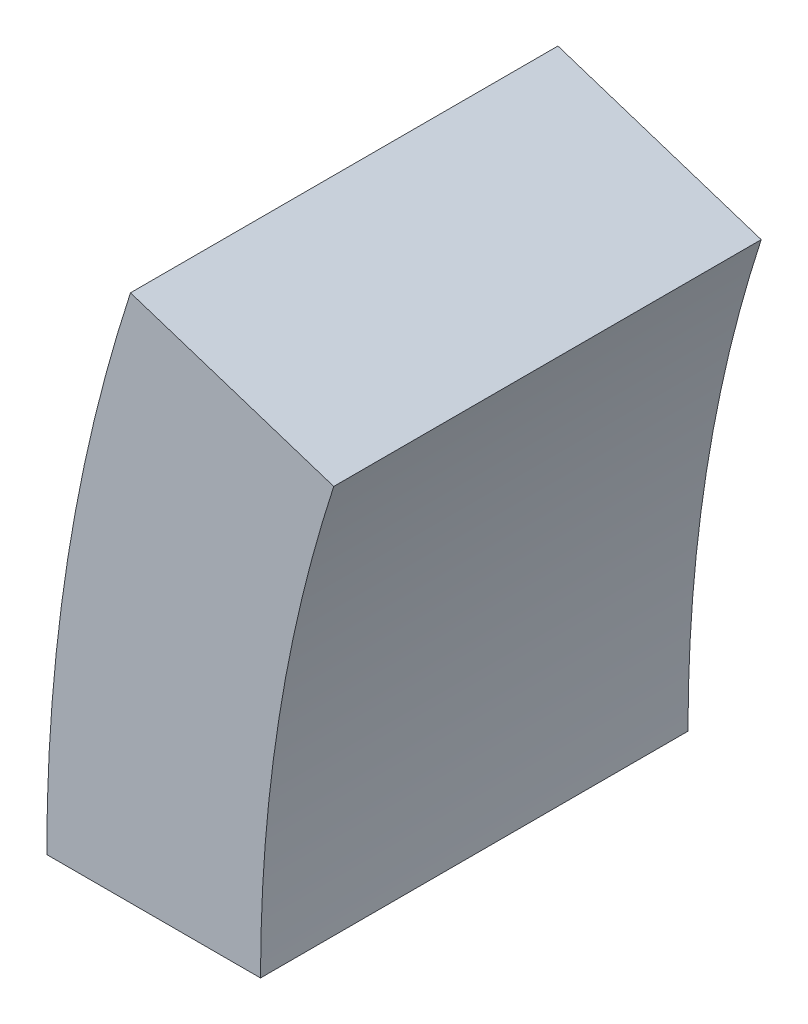
ISO-10303-21;
HEADER;
FILE_DESCRIPTION(('STEP AP214'),'2;1');
FILE_NAME('part.step','',(''),(''),'','','');
FILE_SCHEMA(('AUTOMOTIVE_DESIGN { 1 0 10303 214 1 1 1 1 }'));
ENDSEC;
DATA;
#1=APPLICATION_CONTEXT('core data for automotive mechanical design processes');
#2=APPLICATION_PROTOCOL_DEFINITION('international standard','automotive_design',2000,#1);
#3=PRODUCT_CONTEXT('',#1,'mechanical');
#4=PRODUCT('Part','Part','',(#3));
#5=PRODUCT_RELATED_PRODUCT_CATEGORY('part','',(#4));
#6=PRODUCT_DEFINITION_FORMATION('','',#4);
#7=PRODUCT_DEFINITION_CONTEXT('part definition',#1,'design');
#8=PRODUCT_DEFINITION('design','',#6,#7);
#9=PRODUCT_DEFINITION_SHAPE('','',#8);
#10=(LENGTH_UNIT() NAMED_UNIT(*) SI_UNIT(.MILLI.,.METRE.));
#11=(NAMED_UNIT(*) PLANE_ANGLE_UNIT() SI_UNIT($,.RADIAN.));
#12=(NAMED_UNIT(*) SI_UNIT($,.STERADIAN.) SOLID_ANGLE_UNIT());
#13=UNCERTAINTY_MEASURE_WITH_UNIT(LENGTH_MEASURE(1.E-05),#10,'distance_accuracy_value','');
#14=(GEOMETRIC_REPRESENTATION_CONTEXT(3) GLOBAL_UNCERTAINTY_ASSIGNED_CONTEXT((#13)) GLOBAL_UNIT_ASSIGNED_CONTEXT((#10,
#11,#12)) REPRESENTATION_CONTEXT('',''));
#15=CARTESIAN_POINT('',(0.,0.,0.));
#16=DIRECTION('',(0.,0.,1.));
#17=DIRECTION('',(1.,0.,0.));
#18=AXIS2_PLACEMENT_3D('',#15,#16,#17);
#19=CARTESIAN_POINT('',(692.484918906787,2131.24943466149,624.));
#20=DIRECTION('',(-0.309016994374956,-0.951056516295151,0.));
#21=DIRECTION('',(0.951056516295151,-0.309016994374956,0.));
#22=AXIS2_PLACEMENT_3D('',#19,#20,#21);
#23=PLANE('',#22);
#24=DIRECTION('',(-0.951056516295151,0.309016994374956,0.));
#25=VECTOR('',#24,1.);
#26=CARTESIAN_POINT('',(692.484918906787,2131.24943466149,0.));
#27=LINE('',#26,#25);
#28=CARTESIAN_POINT('',(-10189.1074315886,5666.89311571489,0.));
#29=VERTEX_POINT('',#28);
#30=CARTESIAN_POINT('',(-10485.8370646727,5763.30641795987,0.));
#31=VERTEX_POINT('',#30);
#32=EDGE_CURVE('E100',#29,#31,#27,.T.);
#33=ORIENTED_EDGE('',*,*,#32,.T.);
#34=DIRECTION('',(0.,0.,-1.));
#35=VECTOR('',#34,1.);
#36=CARTESIAN_POINT('',(-10485.8370646727,5763.30641795987,624.));
#37=LINE('',#36,#35);
#38=CARTESIAN_POINT('',(-10485.8370646727,5763.30641795987,624.));
#39=VERTEX_POINT('',#38);
#40=EDGE_CURVE('E11',#39,#31,#37,.T.);
#41=ORIENTED_EDGE('',*,*,#40,.F.);
#42=DIRECTION('',(-0.951056516295151,0.309016994374956,0.));
#43=VECTOR('',#42,1.);
#44=CARTESIAN_POINT('',(692.484918906787,2131.24943466149,624.));
#45=LINE('',#44,#43);
#46=CARTESIAN_POINT('',(-10189.1074315886,5666.89311571489,624.));
#47=VERTEX_POINT('',#46);
#48=EDGE_CURVE('E86',#47,#39,#45,.T.);
#49=ORIENTED_EDGE('',*,*,#48,.F.);
#50=DIRECTION('',(0.,0.,-1.));
#51=VECTOR('',#50,1.);
#52=CARTESIAN_POINT('',(-10189.1074315886,5666.89311571489,624.));
#53=LINE('',#52,#51);
#54=EDGE_CURVE('E53',#47,#29,#53,.T.);
#55=ORIENTED_EDGE('',*,*,#54,.T.);
#56=EDGE_LOOP('',(#33,#41,#49,#55));
#57=FACE_BOUND('',#56,.T.);
#58=ADVANCED_FACE('F37',(#57),#23,.F.);
#59=CARTESIAN_POINT('',(-8112.,4992.,624.));
#60=DIRECTION('',(0.,0.,-1.));
#61=DIRECTION('',(-1.,0.,0.));
#62=AXIS2_PLACEMENT_3D('',#59,#60,#61);
#63=CYLINDRICAL_SURFACE('',#62,2496.);
#64=CARTESIAN_POINT('',(-8112.,4992.,0.));
#65=DIRECTION('',(0.,0.,1.));
#66=DIRECTION('',(1.,0.,0.));
#67=AXIS2_PLACEMENT_3D('',#64,#65,#66);
#68=CIRCLE('',#67,2496.);
#69=CARTESIAN_POINT('',(-10608.,4992.,0.));
#70=VERTEX_POINT('',#69);
#71=EDGE_CURVE('E91',#31,#70,#68,.T.);
#72=ORIENTED_EDGE('',*,*,#71,.T.);
#73=DIRECTION('',(0.,0.,-1.));
#74=VECTOR('',#73,1.);
#75=CARTESIAN_POINT('',(-10608.,4992.,624.));
#76=LINE('',#75,#74);
#77=CARTESIAN_POINT('',(-10608.,4992.,624.));
#78=VERTEX_POINT('',#77);
#79=EDGE_CURVE('E45',#78,#70,#76,.T.);
#80=ORIENTED_EDGE('',*,*,#79,.F.);
#81=CARTESIAN_POINT('',(-8112.,4992.,624.));
#82=DIRECTION('',(0.,0.,1.));
#83=DIRECTION('',(1.,0.,0.));
#84=AXIS2_PLACEMENT_3D('',#81,#82,#83);
#85=CIRCLE('',#84,2496.);
#86=EDGE_CURVE('E78',#39,#78,#85,.T.);
#87=ORIENTED_EDGE('',*,*,#86,.F.);
#88=ORIENTED_EDGE('',*,*,#40,.T.);
#89=EDGE_LOOP('',(#72,#80,#87,#88));
#90=FACE_BOUND('',#89,.T.);
#91=ADVANCED_FACE('F90',(#90),#63,.T.);
#92=CARTESIAN_POINT('',(9.23705556488126E-12,4991.99999999998,624.));
#93=DIRECTION('',(0.,-1.,0.));
#94=DIRECTION('',(1.,0.,0.));
#95=AXIS2_PLACEMENT_3D('',#92,#93,#94);
#96=PLANE('',#95);
#97=DIRECTION('',(-1.,0.,0.));
#98=VECTOR('',#97,1.);
#99=CARTESIAN_POINT('',(9.23705556488126E-12,4991.99999999998,0.));
#100=LINE('',#99,#98);
#101=CARTESIAN_POINT('',(-10296.,4992.,0.));
#102=VERTEX_POINT('',#101);
#103=EDGE_CURVE('E103',#102,#70,#100,.T.);
#104=ORIENTED_EDGE('',*,*,#103,.F.);
#105=DIRECTION('',(0.,0.,-1.));
#106=VECTOR('',#105,1.);
#107=CARTESIAN_POINT('',(-10296.,4992.,624.));
#108=LINE('',#107,#106);
#109=CARTESIAN_POINT('',(-10296.,4992.,624.));
#110=VERTEX_POINT('',#109);
#111=EDGE_CURVE('E67',#110,#102,#108,.T.);
#112=ORIENTED_EDGE('',*,*,#111,.F.);
#113=DIRECTION('',(-1.,0.,0.));
#114=VECTOR('',#113,1.);
#115=CARTESIAN_POINT('',(9.23705556488126E-12,4991.99999999998,624.));
#116=LINE('',#115,#114);
#117=EDGE_CURVE('E85',#110,#78,#116,.T.);
#118=ORIENTED_EDGE('',*,*,#117,.T.);
#119=ORIENTED_EDGE('',*,*,#79,.T.);
#120=EDGE_LOOP('',(#104,#112,#118,#119));
#121=FACE_BOUND('',#120,.T.);
#122=ADVANCED_FACE('F94',(#121),#96,.T.);
#123=CARTESIAN_POINT('',(-8112.,4992.,624.));
#124=DIRECTION('',(0.,0.,-1.));
#125=DIRECTION('',(-1.,0.,0.));
#126=AXIS2_PLACEMENT_3D('',#123,#124,#125);
#127=CYLINDRICAL_SURFACE('',#126,2184.);
#128=CARTESIAN_POINT('',(-8112.,4992.,0.));
#129=DIRECTION('',(0.,0.,1.));
#130=DIRECTION('',(1.,0.,0.));
#131=AXIS2_PLACEMENT_3D('',#128,#129,#130);
#132=CIRCLE('',#131,2184.);
#133=EDGE_CURVE('E105',#29,#102,#132,.T.);
#134=ORIENTED_EDGE('',*,*,#133,.F.);
#135=ORIENTED_EDGE('',*,*,#54,.F.);
#136=CARTESIAN_POINT('',(-8112.,4992.,624.));
#137=DIRECTION('',(0.,0.,1.));
#138=DIRECTION('',(1.,0.,0.));
#139=AXIS2_PLACEMENT_3D('',#136,#137,#138);
#140=CIRCLE('',#139,2184.);
#141=EDGE_CURVE('E95',#47,#110,#140,.T.);
#142=ORIENTED_EDGE('',*,*,#141,.T.);
#143=ORIENTED_EDGE('',*,*,#111,.T.);
#144=EDGE_LOOP('',(#134,#135,#142,#143));
#145=FACE_BOUND('',#144,.T.);
#146=ADVANCED_FACE('F111',(#145),#127,.F.);
#147=CARTESIAN_POINT('',(0.,0.,624.));
#148=DIRECTION('',(0.,0.,1.));
#149=DIRECTION('',(1.,0.,0.));
#150=AXIS2_PLACEMENT_3D('',#147,#148,#149);
#151=PLANE('',#150);
#152=ORIENTED_EDGE('',*,*,#48,.T.);
#153=ORIENTED_EDGE('',*,*,#86,.T.);
#154=ORIENTED_EDGE('',*,*,#117,.F.);
#155=ORIENTED_EDGE('',*,*,#141,.F.);
#156=EDGE_LOOP('',(#152,#153,#154,#155));
#157=FACE_BOUND('',#156,.T.);
#158=ADVANCED_FACE('F82',(#157),#151,.T.);
#159=CARTESIAN_POINT('',(0.,0.,0.));
#160=DIRECTION('',(0.,0.,1.));
#161=DIRECTION('',(1.,0.,0.));
#162=AXIS2_PLACEMENT_3D('',#159,#160,#161);
#163=PLANE('',#162);
#164=ORIENTED_EDGE('',*,*,#32,.F.);
#165=ORIENTED_EDGE('',*,*,#133,.T.);
#166=ORIENTED_EDGE('',*,*,#103,.T.);
#167=ORIENTED_EDGE('',*,*,#71,.F.);
#168=EDGE_LOOP('',(#164,#165,#166,#167));
#169=FACE_BOUND('',#168,.T.);
#170=ADVANCED_FACE('F110',(#169),#163,.F.);
#171=CLOSED_SHELL('',(#58,#91,#122,#146,#158,#170));
#172=MANIFOLD_SOLID_BREP('B2',#171);
#173=ADVANCED_BREP_SHAPE_REPRESENTATION('',(#18,#172),#14);
#174=SHAPE_DEFINITION_REPRESENTATION(#9,#173);
ENDSEC;
END-ISO-10303-21;
